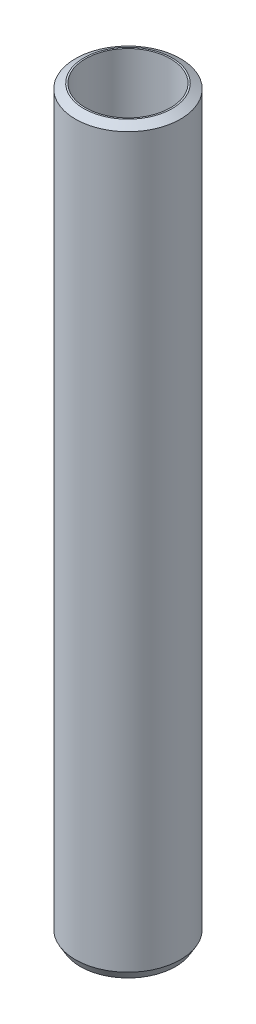
ISO-10303-21;
HEADER;
FILE_DESCRIPTION(('STEP AP214'),'2;1');
FILE_NAME('part.step','',(''),(''),'','','');
FILE_SCHEMA(('AUTOMOTIVE_DESIGN { 1 0 10303 214 1 1 1 1 }'));
ENDSEC;
DATA;
#1=APPLICATION_CONTEXT('core data for automotive mechanical design processes');
#2=APPLICATION_PROTOCOL_DEFINITION('international standard','automotive_design',2000,#1);
#3=PRODUCT_CONTEXT('',#1,'mechanical');
#4=PRODUCT('Part','Part','',(#3));
#5=PRODUCT_RELATED_PRODUCT_CATEGORY('part','',(#4));
#6=PRODUCT_DEFINITION_FORMATION('','',#4);
#7=PRODUCT_DEFINITION_CONTEXT('part definition',#1,'design');
#8=PRODUCT_DEFINITION('design','',#6,#7);
#9=PRODUCT_DEFINITION_SHAPE('','',#8);
#10=(LENGTH_UNIT() NAMED_UNIT(*) SI_UNIT(.MILLI.,.METRE.));
#11=(NAMED_UNIT(*) PLANE_ANGLE_UNIT() SI_UNIT($,.RADIAN.));
#12=(NAMED_UNIT(*) SI_UNIT($,.STERADIAN.) SOLID_ANGLE_UNIT());
#13=UNCERTAINTY_MEASURE_WITH_UNIT(LENGTH_MEASURE(1.E-05),#10,'distance_accuracy_value','');
#14=(GEOMETRIC_REPRESENTATION_CONTEXT(3) GLOBAL_UNCERTAINTY_ASSIGNED_CONTEXT((#13)) GLOBAL_UNIT_ASSIGNED_CONTEXT((#10,
#11,#12)) REPRESENTATION_CONTEXT('',''));
#15=CARTESIAN_POINT('',(0.,0.,0.));
#16=DIRECTION('',(0.,0.,1.));
#17=DIRECTION('',(1.,0.,0.));
#18=AXIS2_PLACEMENT_3D('',#15,#16,#17);
#19=CARTESIAN_POINT('',(0.,600.,0.));
#20=DIRECTION('',(0.,-1.,0.));
#21=DIRECTION('',(0.,0.,-1.));
#22=AXIS2_PLACEMENT_3D('',#19,#20,#21);
#23=CYLINDRICAL_SURFACE('',#22,42.5);
#24=CARTESIAN_POINT('',(0.,596.055217120145,0.));
#25=DIRECTION('',(0.,1.,0.));
#26=DIRECTION('',(0.,0.,1.));
#27=AXIS2_PLACEMENT_3D('',#24,#25,#26);
#28=CIRCLE('',#27,42.5);
#29=CARTESIAN_POINT('',(0.,596.055217120145,42.5));
#30=VERTEX_POINT('',#29);
#31=EDGE_CURVE('E50',#30,#30,#28,.F.);
#32=ORIENTED_EDGE('',*,*,#31,.T.);
#33=EDGE_LOOP('',(#32));
#34=FACE_BOUND('',#33,.T.);
#35=CARTESIAN_POINT('',(0.,6.83256437273572,0.));
#36=DIRECTION('',(0.,1.,0.));
#37=DIRECTION('',(0.,0.,1.));
#38=AXIS2_PLACEMENT_3D('',#35,#36,#37);
#39=CIRCLE('',#38,42.5);
#40=CARTESIAN_POINT('',(0.,6.83256437273572,42.5));
#41=VERTEX_POINT('',#40);
#42=EDGE_CURVE('E51',#41,#41,#39,.T.);
#43=ORIENTED_EDGE('',*,*,#42,.T.);
#44=EDGE_LOOP('',(#43));
#45=FACE_BOUND('',#44,.T.);
#46=ADVANCED_FACE('F39',(#34,#45),#23,.T.);
#47=CARTESIAN_POINT('',(0.,600.,0.));
#48=DIRECTION('',(0.,1.,0.));
#49=DIRECTION('',(0.,0.,1.));
#50=AXIS2_PLACEMENT_3D('',#47,#48,#49);
#51=PLANE('',#50);
#52=CARTESIAN_POINT('',(0.,600.,0.));
#53=DIRECTION('',(0.,1.,0.));
#54=DIRECTION('',(0.,0.,1.));
#55=AXIS2_PLACEMENT_3D('',#52,#53,#54);
#56=CIRCLE('',#55,35.667435627264);
#57=CARTESIAN_POINT('',(0.,600.,35.667435627264));
#58=VERTEX_POINT('',#57);
#59=EDGE_CURVE('E54',#58,#58,#56,.T.);
#60=ORIENTED_EDGE('',*,*,#59,.T.);
#61=EDGE_LOOP('',(#60));
#62=FACE_BOUND('',#61,.T.);
#63=CARTESIAN_POINT('',(0.,600.,0.));
#64=DIRECTION('',(0.,1.,0.));
#65=DIRECTION('',(0.,0.,1.));
#66=AXIS2_PLACEMENT_3D('',#63,#64,#65);
#67=CIRCLE('',#66,34.4127621921179);
#68=CARTESIAN_POINT('',(0.,600.,34.4127621921179));
#69=VERTEX_POINT('',#68);
#70=EDGE_CURVE('E58',#69,#69,#67,.T.);
#71=ORIENTED_EDGE('',*,*,#70,.F.);
#72=EDGE_LOOP('',(#71));
#73=FACE_BOUND('',#72,.T.);
#74=ADVANCED_FACE('F69',(#62,#73),#51,.T.);
#75=CARTESIAN_POINT('',(0.,0.,0.));
#76=DIRECTION('',(0.,1.,0.));
#77=DIRECTION('',(0.,0.,1.));
#78=AXIS2_PLACEMENT_3D('',#75,#76,#77);
#79=PLANE('',#78);
#80=CARTESIAN_POINT('',(0.,0.,0.));
#81=DIRECTION('',(0.,1.,0.));
#82=DIRECTION('',(0.,0.,1.));
#83=AXIS2_PLACEMENT_3D('',#80,#81,#82);
#84=CIRCLE('',#83,38.5552171201455);
#85=CARTESIAN_POINT('',(0.,0.,38.5552171201455));
#86=VERTEX_POINT('',#85);
#87=EDGE_CURVE('E10',#86,#86,#84,.F.);
#88=ORIENTED_EDGE('',*,*,#87,.T.);
#89=EDGE_LOOP('',(#88));
#90=FACE_BOUND('',#89,.T.);
#91=CARTESIAN_POINT('',(0.,0.,0.));
#92=DIRECTION('',(0.,1.,0.));
#93=DIRECTION('',(0.,0.,1.));
#94=AXIS2_PLACEMENT_3D('',#91,#92,#93);
#95=CIRCLE('',#94,34.4127621921179);
#96=CARTESIAN_POINT('',(0.,0.,34.4127621921179));
#97=VERTEX_POINT('',#96);
#98=EDGE_CURVE('E63',#97,#97,#95,.T.);
#99=ORIENTED_EDGE('',*,*,#98,.T.);
#100=EDGE_LOOP('',(#99));
#101=FACE_BOUND('',#100,.T.);
#102=ADVANCED_FACE('F75',(#90,#101),#79,.F.);
#103=CARTESIAN_POINT('',(0.,600.,0.));
#104=DIRECTION('',(0.,-1.,0.));
#105=DIRECTION('',(0.,0.,-1.));
#106=AXIS2_PLACEMENT_3D('',#103,#104,#105);
#107=CYLINDRICAL_SURFACE('',#106,34.4127621921179);
#108=ORIENTED_EDGE('',*,*,#70,.T.);
#109=EDGE_LOOP('',(#108));
#110=FACE_BOUND('',#109,.T.);
#111=ORIENTED_EDGE('',*,*,#98,.F.);
#112=EDGE_LOOP('',(#111));
#113=FACE_BOUND('',#112,.T.);
#114=ADVANCED_FACE('F70',(#110,#113),#107,.F.);
#115=CARTESIAN_POINT('',(0.,600.,0.));
#116=DIRECTION('',(0.,-1.,0.));
#117=DIRECTION('',(0.,0.,-1.));
#118=AXIS2_PLACEMENT_3D('',#115,#116,#117);
#119=CONICAL_SURFACE('',#118,35.667435627264,1.0471975511966);
#120=ORIENTED_EDGE('',*,*,#31,.F.);
#121=EDGE_LOOP('',(#120));
#122=FACE_BOUND('',#121,.T.);
#123=ORIENTED_EDGE('',*,*,#59,.F.);
#124=EDGE_LOOP('',(#123));
#125=FACE_BOUND('',#124,.T.);
#126=ADVANCED_FACE('F81',(#122,#125),#119,.T.);
#127=CARTESIAN_POINT('',(0.,6.83256437273572,0.));
#128=DIRECTION('',(0.,1.,0.));
#129=DIRECTION('',(0.,0.,1.));
#130=AXIS2_PLACEMENT_3D('',#127,#128,#129);
#131=CONICAL_SURFACE('',#130,42.5,0.523598775598306);
#132=ORIENTED_EDGE('',*,*,#87,.F.);
#133=EDGE_LOOP('',(#132));
#134=FACE_BOUND('',#133,.T.);
#135=ORIENTED_EDGE('',*,*,#42,.F.);
#136=EDGE_LOOP('',(#135));
#137=FACE_BOUND('',#136,.T.);
#138=ADVANCED_FACE('F45',(#134,#137),#131,.T.);
#139=CLOSED_SHELL('',(#46,#74,#102,#114,#126,#138));
#140=MANIFOLD_SOLID_BREP('B2',#139);
#141=ADVANCED_BREP_SHAPE_REPRESENTATION('',(#18,#140),#14);
#142=SHAPE_DEFINITION_REPRESENTATION(#9,#141);
ENDSEC;
END-ISO-10303-21;
